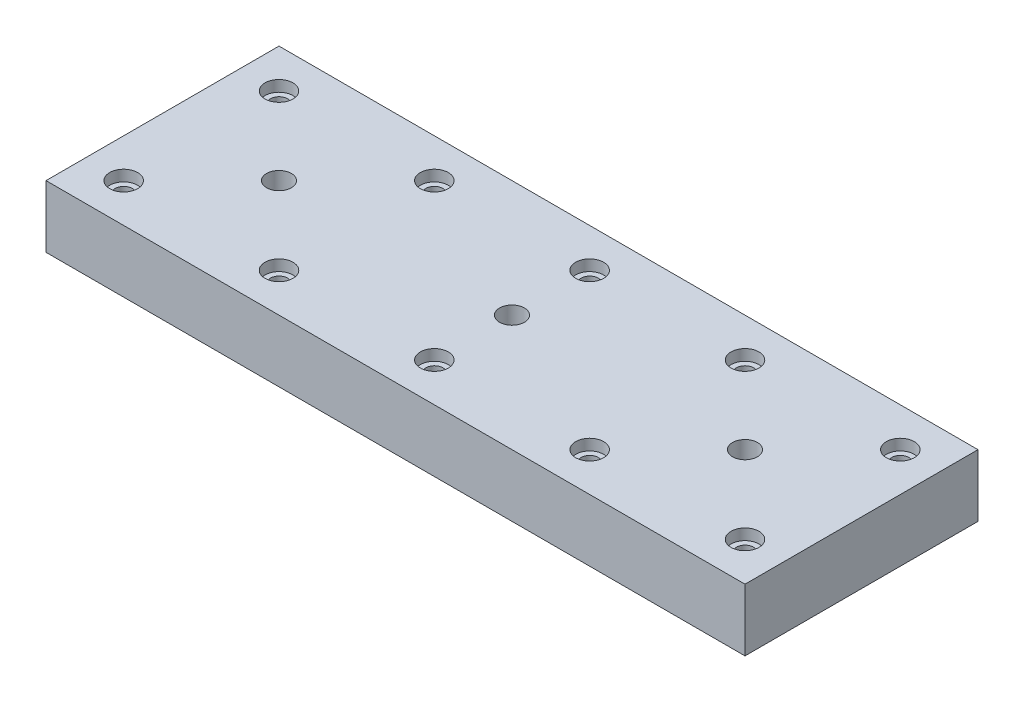
ISO-10303-21;
HEADER;
FILE_DESCRIPTION(('STEP AP214'),'2;1');
FILE_NAME('part.step','',(''),(''),'','','');
FILE_SCHEMA(('AUTOMOTIVE_DESIGN { 1 0 10303 214 1 1 1 1 }'));
ENDSEC;
DATA;
#1=APPLICATION_CONTEXT('core data for automotive mechanical design processes');
#2=APPLICATION_PROTOCOL_DEFINITION('international standard','automotive_design',2000,#1);
#3=PRODUCT_CONTEXT('',#1,'mechanical');
#4=PRODUCT('Part','Part','',(#3));
#5=PRODUCT_RELATED_PRODUCT_CATEGORY('part','',(#4));
#6=PRODUCT_DEFINITION_FORMATION('','',#4);
#7=PRODUCT_DEFINITION_CONTEXT('part definition',#1,'design');
#8=PRODUCT_DEFINITION('design','',#6,#7);
#9=PRODUCT_DEFINITION_SHAPE('','',#8);
#10=(LENGTH_UNIT() NAMED_UNIT(*) SI_UNIT(.MILLI.,.METRE.));
#11=(NAMED_UNIT(*) PLANE_ANGLE_UNIT() SI_UNIT($,.RADIAN.));
#12=(NAMED_UNIT(*) SI_UNIT($,.STERADIAN.) SOLID_ANGLE_UNIT());
#13=UNCERTAINTY_MEASURE_WITH_UNIT(LENGTH_MEASURE(1.E-05),#10,'distance_accuracy_value','');
#14=(GEOMETRIC_REPRESENTATION_CONTEXT(3) GLOBAL_UNCERTAINTY_ASSIGNED_CONTEXT((#13)) GLOBAL_UNIT_ASSIGNED_CONTEXT((#10,
#11,#12)) REPRESENTATION_CONTEXT('',''));
#15=CARTESIAN_POINT('',(0.,0.,0.));
#16=DIRECTION('',(0.,0.,1.));
#17=DIRECTION('',(1.,0.,0.));
#18=AXIS2_PLACEMENT_3D('',#15,#16,#17);
#19=CARTESIAN_POINT('',(0.,40.,0.));
#20=DIRECTION('',(0.,-1.,0.));
#21=DIRECTION('',(0.,0.,-1.));
#22=AXIS2_PLACEMENT_3D('',#19,#20,#21);
#23=PLANE('',#22);
#24=CARTESIAN_POINT('',(-200.,40.,-50.));
#25=DIRECTION('',(0.,1.,0.));
#26=DIRECTION('',(0.,0.,1.));
#27=AXIS2_PLACEMENT_3D('',#24,#25,#26);
#28=CIRCLE('',#27,9.00000000000001);
#29=CARTESIAN_POINT('',(-200.,40.,-41.));
#30=VERTEX_POINT('',#29);
#31=EDGE_CURVE('E229',#30,#30,#28,.T.);
#32=ORIENTED_EDGE('',*,*,#31,.F.);
#33=EDGE_LOOP('',(#32));
#34=FACE_BOUND('',#33,.T.);
#35=CARTESIAN_POINT('',(-100.,40.,-50.));
#36=DIRECTION('',(0.,1.,0.));
#37=DIRECTION('',(0.,0.,1.));
#38=AXIS2_PLACEMENT_3D('',#35,#36,#37);
#39=CIRCLE('',#38,8.99999999999999);
#40=CARTESIAN_POINT('',(-100.,40.,-41.));
#41=VERTEX_POINT('',#40);
#42=EDGE_CURVE('E217',#41,#41,#39,.T.);
#43=ORIENTED_EDGE('',*,*,#42,.F.);
#44=EDGE_LOOP('',(#43));
#45=FACE_BOUND('',#44,.T.);
#46=CARTESIAN_POINT('',(0.,40.,-50.));
#47=DIRECTION('',(0.,1.,0.));
#48=DIRECTION('',(0.,0.,1.));
#49=AXIS2_PLACEMENT_3D('',#46,#47,#48);
#50=CIRCLE('',#49,9.);
#51=CARTESIAN_POINT('',(0.,40.,-41.));
#52=VERTEX_POINT('',#51);
#53=EDGE_CURVE('E205',#52,#52,#50,.T.);
#54=ORIENTED_EDGE('',*,*,#53,.F.);
#55=EDGE_LOOP('',(#54));
#56=FACE_BOUND('',#55,.T.);
#57=CARTESIAN_POINT('',(100.,40.,-50.));
#58=DIRECTION('',(0.,1.,0.));
#59=DIRECTION('',(0.,0.,1.));
#60=AXIS2_PLACEMENT_3D('',#57,#58,#59);
#61=CIRCLE('',#60,8.99999999999999);
#62=CARTESIAN_POINT('',(100.,40.,-41.));
#63=VERTEX_POINT('',#62);
#64=EDGE_CURVE('E193',#63,#63,#61,.T.);
#65=ORIENTED_EDGE('',*,*,#64,.F.);
#66=EDGE_LOOP('',(#65));
#67=FACE_BOUND('',#66,.T.);
#68=CARTESIAN_POINT('',(200.,40.,-50.));
#69=DIRECTION('',(0.,1.,0.));
#70=DIRECTION('',(0.,0.,1.));
#71=AXIS2_PLACEMENT_3D('',#68,#69,#70);
#72=CIRCLE('',#71,9.00000000000001);
#73=CARTESIAN_POINT('',(200.,40.,-41.));
#74=VERTEX_POINT('',#73);
#75=EDGE_CURVE('E181',#74,#74,#72,.T.);
#76=ORIENTED_EDGE('',*,*,#75,.F.);
#77=EDGE_LOOP('',(#76));
#78=FACE_BOUND('',#77,.T.);
#79=CARTESIAN_POINT('',(-99.9999999999947,40.,50.));
#80=DIRECTION('',(0.,1.,0.));
#81=DIRECTION('',(0.,0.,1.));
#82=AXIS2_PLACEMENT_3D('',#79,#80,#81);
#83=CIRCLE('',#82,8.99999999999999);
#84=CARTESIAN_POINT('',(-99.9999999999947,40.,59.));
#85=VERTEX_POINT('',#84);
#86=EDGE_CURVE('E169',#85,#85,#83,.T.);
#87=ORIENTED_EDGE('',*,*,#86,.F.);
#88=EDGE_LOOP('',(#87));
#89=FACE_BOUND('',#88,.T.);
#90=CARTESIAN_POINT('',(5.27355936696949E-12,40.,50.));
#91=DIRECTION('',(0.,1.,0.));
#92=DIRECTION('',(0.,0.,1.));
#93=AXIS2_PLACEMENT_3D('',#90,#91,#92);
#94=CIRCLE('',#93,9.);
#95=CARTESIAN_POINT('',(5.27355936696949E-12,40.,59.));
#96=VERTEX_POINT('',#95);
#97=EDGE_CURVE('E157',#96,#96,#94,.T.);
#98=ORIENTED_EDGE('',*,*,#97,.F.);
#99=EDGE_LOOP('',(#98));
#100=FACE_BOUND('',#99,.T.);
#101=CARTESIAN_POINT('',(100.000000000005,40.,50.));
#102=DIRECTION('',(0.,1.,0.));
#103=DIRECTION('',(0.,0.,1.));
#104=AXIS2_PLACEMENT_3D('',#101,#102,#103);
#105=CIRCLE('',#104,8.99999999999999);
#106=CARTESIAN_POINT('',(100.000000000005,40.,59.));
#107=VERTEX_POINT('',#106);
#108=EDGE_CURVE('E145',#107,#107,#105,.T.);
#109=ORIENTED_EDGE('',*,*,#108,.F.);
#110=EDGE_LOOP('',(#109));
#111=FACE_BOUND('',#110,.T.);
#112=CARTESIAN_POINT('',(200.000000000005,40.,50.));
#113=DIRECTION('',(0.,1.,0.));
#114=DIRECTION('',(0.,0.,1.));
#115=AXIS2_PLACEMENT_3D('',#112,#113,#114);
#116=CIRCLE('',#115,9.00000000000001);
#117=CARTESIAN_POINT('',(200.000000000005,40.,59.));
#118=VERTEX_POINT('',#117);
#119=EDGE_CURVE('E133',#118,#118,#116,.T.);
#120=ORIENTED_EDGE('',*,*,#119,.F.);
#121=EDGE_LOOP('',(#120));
#122=FACE_BOUND('',#121,.T.);
#123=CARTESIAN_POINT('',(-199.999999999995,40.,50.));
#124=DIRECTION('',(0.,1.,0.));
#125=DIRECTION('',(0.,0.,1.));
#126=AXIS2_PLACEMENT_3D('',#123,#124,#125);
#127=CIRCLE('',#126,9.00000000000001);
#128=CARTESIAN_POINT('',(-199.999999999995,40.,59.));
#129=VERTEX_POINT('',#128);
#130=EDGE_CURVE('E121',#129,#129,#127,.T.);
#131=ORIENTED_EDGE('',*,*,#130,.F.);
#132=EDGE_LOOP('',(#131));
#133=FACE_BOUND('',#132,.T.);
#134=DIRECTION('',(0.,0.,-1.));
#135=VECTOR('',#134,1.);
#136=CARTESIAN_POINT('',(225.,40.,75.));
#137=LINE('',#136,#135);
#138=CARTESIAN_POINT('',(225.,40.,75.));
#139=VERTEX_POINT('',#138);
#140=CARTESIAN_POINT('',(225.,40.,-75.));
#141=VERTEX_POINT('',#140);
#142=EDGE_CURVE('E87',#139,#141,#137,.T.);
#143=ORIENTED_EDGE('',*,*,#142,.T.);
#144=DIRECTION('',(-1.,0.,0.));
#145=VECTOR('',#144,1.);
#146=CARTESIAN_POINT('',(-225.,40.,-75.));
#147=LINE('',#146,#145);
#148=CARTESIAN_POINT('',(-225.,40.,-75.));
#149=VERTEX_POINT('',#148);
#150=EDGE_CURVE('E82',#141,#149,#147,.T.);
#151=ORIENTED_EDGE('',*,*,#150,.T.);
#152=DIRECTION('',(0.,0.,1.));
#153=VECTOR('',#152,1.);
#154=CARTESIAN_POINT('',(-225.,40.,75.));
#155=LINE('',#154,#153);
#156=CARTESIAN_POINT('',(-225.,40.,75.));
#157=VERTEX_POINT('',#156);
#158=EDGE_CURVE('E85',#149,#157,#155,.T.);
#159=ORIENTED_EDGE('',*,*,#158,.T.);
#160=DIRECTION('',(1.,0.,0.));
#161=VECTOR('',#160,1.);
#162=CARTESIAN_POINT('',(-225.,40.,75.));
#163=LINE('',#162,#161);
#164=EDGE_CURVE('E52',#157,#139,#163,.T.);
#165=ORIENTED_EDGE('',*,*,#164,.T.);
#166=EDGE_LOOP('',(#143,#151,#159,#165));
#167=FACE_BOUND('',#166,.T.);
#168=CARTESIAN_POINT('',(-150.,40.,0.));
#169=DIRECTION('',(0.,1.,0.));
#170=DIRECTION('',(0.,0.,1.));
#171=AXIS2_PLACEMENT_3D('',#168,#169,#170);
#172=CIRCLE('',#171,8.00000000000001);
#173=CARTESIAN_POINT('',(-150.,40.,8.00000000000001));
#174=VERTEX_POINT('',#173);
#175=EDGE_CURVE('E235',#174,#174,#172,.T.);
#176=ORIENTED_EDGE('',*,*,#175,.F.);
#177=EDGE_LOOP('',(#176));
#178=FACE_BOUND('',#177,.T.);
#179=CARTESIAN_POINT('',(0.,40.,0.));
#180=DIRECTION('',(0.,1.,0.));
#181=DIRECTION('',(0.,0.,1.));
#182=AXIS2_PLACEMENT_3D('',#179,#180,#181);
#183=CIRCLE('',#182,7.99999999999999);
#184=CARTESIAN_POINT('',(0.,40.,7.99999999999999));
#185=VERTEX_POINT('',#184);
#186=EDGE_CURVE('E241',#185,#185,#183,.T.);
#187=ORIENTED_EDGE('',*,*,#186,.F.);
#188=EDGE_LOOP('',(#187));
#189=FACE_BOUND('',#188,.T.);
#190=CARTESIAN_POINT('',(150.,40.,0.));
#191=DIRECTION('',(0.,1.,0.));
#192=DIRECTION('',(0.,0.,1.));
#193=AXIS2_PLACEMENT_3D('',#190,#191,#192);
#194=CIRCLE('',#193,8.00000000000001);
#195=CARTESIAN_POINT('',(150.,40.,8.00000000000001));
#196=VERTEX_POINT('',#195);
#197=EDGE_CURVE('E247',#196,#196,#194,.T.);
#198=ORIENTED_EDGE('',*,*,#197,.F.);
#199=EDGE_LOOP('',(#198));
#200=FACE_BOUND('',#199,.T.);
#201=ADVANCED_FACE('F35',(#34,#45,#56,#67,#78,#89,#100,#111,#122,#133,#167,#178,#189,#200),#23,.F.);
#202=CARTESIAN_POINT('',(225.,40.,75.));
#203=DIRECTION('',(-1.,0.,0.));
#204=DIRECTION('',(0.,0.,1.));
#205=AXIS2_PLACEMENT_3D('',#202,#203,#204);
#206=PLANE('',#205);
#207=DIRECTION('',(0.,0.,-1.));
#208=VECTOR('',#207,1.);
#209=CARTESIAN_POINT('',(225.,0.,75.));
#210=LINE('',#209,#208);
#211=CARTESIAN_POINT('',(225.,0.,75.));
#212=VERTEX_POINT('',#211);
#213=CARTESIAN_POINT('',(225.,0.,-75.));
#214=VERTEX_POINT('',#213);
#215=EDGE_CURVE('E99',#212,#214,#210,.T.);
#216=ORIENTED_EDGE('',*,*,#215,.T.);
#217=DIRECTION('',(0.,-1.,0.));
#218=VECTOR('',#217,1.);
#219=CARTESIAN_POINT('',(225.,40.,-75.));
#220=LINE('',#219,#218);
#221=EDGE_CURVE('E11',#141,#214,#220,.T.);
#222=ORIENTED_EDGE('',*,*,#221,.F.);
#223=ORIENTED_EDGE('',*,*,#142,.F.);
#224=DIRECTION('',(0.,-1.,0.));
#225=VECTOR('',#224,1.);
#226=CARTESIAN_POINT('',(225.,40.,75.));
#227=LINE('',#226,#225);
#228=EDGE_CURVE('E95',#139,#212,#227,.T.);
#229=ORIENTED_EDGE('',*,*,#228,.T.);
#230=EDGE_LOOP('',(#216,#222,#223,#229));
#231=FACE_BOUND('',#230,.T.);
#232=ADVANCED_FACE('F37',(#231),#206,.F.);
#233=CARTESIAN_POINT('',(-225.,40.,-75.));
#234=DIRECTION('',(0.,0.,1.));
#235=DIRECTION('',(1.,0.,0.));
#236=AXIS2_PLACEMENT_3D('',#233,#234,#235);
#237=PLANE('',#236);
#238=DIRECTION('',(-1.,0.,0.));
#239=VECTOR('',#238,1.);
#240=CARTESIAN_POINT('',(-225.,0.,-75.));
#241=LINE('',#240,#239);
#242=CARTESIAN_POINT('',(-225.,0.,-75.));
#243=VERTEX_POINT('',#242);
#244=EDGE_CURVE('E91',#214,#243,#241,.T.);
#245=ORIENTED_EDGE('',*,*,#244,.T.);
#246=DIRECTION('',(0.,-1.,0.));
#247=VECTOR('',#246,1.);
#248=CARTESIAN_POINT('',(-225.,40.,-75.));
#249=LINE('',#248,#247);
#250=EDGE_CURVE('E44',#149,#243,#249,.T.);
#251=ORIENTED_EDGE('',*,*,#250,.F.);
#252=ORIENTED_EDGE('',*,*,#150,.F.);
#253=ORIENTED_EDGE('',*,*,#221,.T.);
#254=EDGE_LOOP('',(#245,#251,#252,#253));
#255=FACE_BOUND('',#254,.T.);
#256=ADVANCED_FACE('F90',(#255),#237,.F.);
#257=CARTESIAN_POINT('',(-225.,40.,75.));
#258=DIRECTION('',(1.,0.,0.));
#259=DIRECTION('',(0.,0.,-1.));
#260=AXIS2_PLACEMENT_3D('',#257,#258,#259);
#261=PLANE('',#260);
#262=DIRECTION('',(0.,0.,1.));
#263=VECTOR('',#262,1.);
#264=CARTESIAN_POINT('',(-225.,0.,75.));
#265=LINE('',#264,#263);
#266=CARTESIAN_POINT('',(-225.,0.,75.));
#267=VERTEX_POINT('',#266);
#268=EDGE_CURVE('E69',#243,#267,#265,.T.);
#269=ORIENTED_EDGE('',*,*,#268,.T.);
#270=DIRECTION('',(0.,-1.,0.));
#271=VECTOR('',#270,1.);
#272=CARTESIAN_POINT('',(-225.,40.,75.));
#273=LINE('',#272,#271);
#274=EDGE_CURVE('E92',#157,#267,#273,.T.);
#275=ORIENTED_EDGE('',*,*,#274,.F.);
#276=ORIENTED_EDGE('',*,*,#158,.F.);
#277=ORIENTED_EDGE('',*,*,#250,.T.);
#278=EDGE_LOOP('',(#269,#275,#276,#277));
#279=FACE_BOUND('',#278,.T.);
#280=ADVANCED_FACE('F93',(#279),#261,.F.);
#281=CARTESIAN_POINT('',(-225.,40.,75.));
#282=DIRECTION('',(0.,0.,-1.));
#283=DIRECTION('',(-1.,0.,0.));
#284=AXIS2_PLACEMENT_3D('',#281,#282,#283);
#285=PLANE('',#284);
#286=DIRECTION('',(1.,0.,0.));
#287=VECTOR('',#286,1.);
#288=CARTESIAN_POINT('',(-225.,0.,75.));
#289=LINE('',#288,#287);
#290=EDGE_CURVE('E75',#267,#212,#289,.T.);
#291=ORIENTED_EDGE('',*,*,#290,.T.);
#292=ORIENTED_EDGE('',*,*,#228,.F.);
#293=ORIENTED_EDGE('',*,*,#164,.F.);
#294=ORIENTED_EDGE('',*,*,#274,.T.);
#295=EDGE_LOOP('',(#291,#292,#293,#294));
#296=FACE_BOUND('',#295,.T.);
#297=ADVANCED_FACE('F107',(#296),#285,.F.);
#298=CARTESIAN_POINT('',(0.,0.,0.));
#299=DIRECTION('',(0.,-1.,0.));
#300=DIRECTION('',(0.,0.,-1.));
#301=AXIS2_PLACEMENT_3D('',#298,#299,#300);
#302=PLANE('',#301);
#303=CARTESIAN_POINT('',(150.,0.,0.));
#304=DIRECTION('',(0.,-1.,0.));
#305=DIRECTION('',(0.,0.,-1.));
#306=AXIS2_PLACEMENT_3D('',#303,#304,#305);
#307=CIRCLE('',#306,7.99999999999999);
#308=CARTESIAN_POINT('',(150.,0.,-7.99999999999999));
#309=VERTEX_POINT('',#308);
#310=EDGE_CURVE('E244',#309,#309,#307,.T.);
#311=ORIENTED_EDGE('',*,*,#310,.F.);
#312=EDGE_LOOP('',(#311));
#313=FACE_BOUND('',#312,.T.);
#314=CARTESIAN_POINT('',(0.,0.,0.));
#315=DIRECTION('',(0.,-1.,0.));
#316=DIRECTION('',(0.,0.,-1.));
#317=AXIS2_PLACEMENT_3D('',#314,#315,#316);
#318=CIRCLE('',#317,7.99999999999999);
#319=CARTESIAN_POINT('',(0.,0.,-7.99999999999999));
#320=VERTEX_POINT('',#319);
#321=EDGE_CURVE('E238',#320,#320,#318,.T.);
#322=ORIENTED_EDGE('',*,*,#321,.F.);
#323=EDGE_LOOP('',(#322));
#324=FACE_BOUND('',#323,.T.);
#325=CARTESIAN_POINT('',(-150.,0.,0.));
#326=DIRECTION('',(0.,-1.,0.));
#327=DIRECTION('',(0.,0.,-1.));
#328=AXIS2_PLACEMENT_3D('',#325,#326,#327);
#329=CIRCLE('',#328,7.99999999999999);
#330=CARTESIAN_POINT('',(-150.,0.,-7.99999999999999));
#331=VERTEX_POINT('',#330);
#332=EDGE_CURVE('E232',#331,#331,#329,.T.);
#333=ORIENTED_EDGE('',*,*,#332,.F.);
#334=EDGE_LOOP('',(#333));
#335=FACE_BOUND('',#334,.T.);
#336=CARTESIAN_POINT('',(-200.,0.,-50.));
#337=DIRECTION('',(0.,-1.,0.));
#338=DIRECTION('',(0.,0.,-1.));
#339=AXIS2_PLACEMENT_3D('',#336,#337,#338);
#340=CIRCLE('',#339,5.49999999999999);
#341=CARTESIAN_POINT('',(-200.,0.,-55.5));
#342=VERTEX_POINT('',#341);
#343=EDGE_CURVE('E220',#342,#342,#340,.T.);
#344=ORIENTED_EDGE('',*,*,#343,.F.);
#345=EDGE_LOOP('',(#344));
#346=FACE_BOUND('',#345,.T.);
#347=CARTESIAN_POINT('',(-100.,0.,-50.));
#348=DIRECTION('',(0.,-1.,0.));
#349=DIRECTION('',(0.,0.,-1.));
#350=AXIS2_PLACEMENT_3D('',#347,#348,#349);
#351=CIRCLE('',#350,5.5);
#352=CARTESIAN_POINT('',(-100.,0.,-55.5));
#353=VERTEX_POINT('',#352);
#354=EDGE_CURVE('E208',#353,#353,#351,.T.);
#355=ORIENTED_EDGE('',*,*,#354,.F.);
#356=EDGE_LOOP('',(#355));
#357=FACE_BOUND('',#356,.T.);
#358=CARTESIAN_POINT('',(0.,0.,-50.));
#359=DIRECTION('',(0.,-1.,0.));
#360=DIRECTION('',(0.,0.,-1.));
#361=AXIS2_PLACEMENT_3D('',#358,#359,#360);
#362=CIRCLE('',#361,5.49999999999999);
#363=CARTESIAN_POINT('',(0.,0.,-55.5));
#364=VERTEX_POINT('',#363);
#365=EDGE_CURVE('E196',#364,#364,#362,.T.);
#366=ORIENTED_EDGE('',*,*,#365,.F.);
#367=EDGE_LOOP('',(#366));
#368=FACE_BOUND('',#367,.T.);
#369=CARTESIAN_POINT('',(100.,0.,-50.));
#370=DIRECTION('',(0.,-1.,0.));
#371=DIRECTION('',(0.,0.,-1.));
#372=AXIS2_PLACEMENT_3D('',#369,#370,#371);
#373=CIRCLE('',#372,5.5);
#374=CARTESIAN_POINT('',(100.,0.,-55.5));
#375=VERTEX_POINT('',#374);
#376=EDGE_CURVE('E184',#375,#375,#373,.T.);
#377=ORIENTED_EDGE('',*,*,#376,.F.);
#378=EDGE_LOOP('',(#377));
#379=FACE_BOUND('',#378,.T.);
#380=CARTESIAN_POINT('',(200.,0.,-50.));
#381=DIRECTION('',(0.,-1.,0.));
#382=DIRECTION('',(0.,0.,-1.));
#383=AXIS2_PLACEMENT_3D('',#380,#381,#382);
#384=CIRCLE('',#383,5.49999999999999);
#385=CARTESIAN_POINT('',(200.,0.,-55.5));
#386=VERTEX_POINT('',#385);
#387=EDGE_CURVE('E172',#386,#386,#384,.T.);
#388=ORIENTED_EDGE('',*,*,#387,.F.);
#389=EDGE_LOOP('',(#388));
#390=FACE_BOUND('',#389,.T.);
#391=CARTESIAN_POINT('',(-99.9999999999947,0.,50.));
#392=DIRECTION('',(0.,-1.,0.));
#393=DIRECTION('',(0.,0.,-1.));
#394=AXIS2_PLACEMENT_3D('',#391,#392,#393);
#395=CIRCLE('',#394,5.49999999999999);
#396=CARTESIAN_POINT('',(-99.9999999999947,0.,44.5));
#397=VERTEX_POINT('',#396);
#398=EDGE_CURVE('E160',#397,#397,#395,.T.);
#399=ORIENTED_EDGE('',*,*,#398,.F.);
#400=EDGE_LOOP('',(#399));
#401=FACE_BOUND('',#400,.T.);
#402=CARTESIAN_POINT('',(5.27355936696949E-12,0.,50.));
#403=DIRECTION('',(0.,-1.,0.));
#404=DIRECTION('',(0.,0.,-1.));
#405=AXIS2_PLACEMENT_3D('',#402,#403,#404);
#406=CIRCLE('',#405,5.49999999999999);
#407=CARTESIAN_POINT('',(5.27355936696949E-12,0.,44.5));
#408=VERTEX_POINT('',#407);
#409=EDGE_CURVE('E148',#408,#408,#406,.T.);
#410=ORIENTED_EDGE('',*,*,#409,.F.);
#411=EDGE_LOOP('',(#410));
#412=FACE_BOUND('',#411,.T.);
#413=CARTESIAN_POINT('',(100.000000000005,0.,50.));
#414=DIRECTION('',(0.,-1.,0.));
#415=DIRECTION('',(0.,0.,-1.));
#416=AXIS2_PLACEMENT_3D('',#413,#414,#415);
#417=CIRCLE('',#416,5.5);
#418=CARTESIAN_POINT('',(100.000000000005,0.,44.5));
#419=VERTEX_POINT('',#418);
#420=EDGE_CURVE('E136',#419,#419,#417,.T.);
#421=ORIENTED_EDGE('',*,*,#420,.F.);
#422=EDGE_LOOP('',(#421));
#423=FACE_BOUND('',#422,.T.);
#424=CARTESIAN_POINT('',(200.000000000005,0.,50.));
#425=DIRECTION('',(0.,-1.,0.));
#426=DIRECTION('',(0.,0.,-1.));
#427=AXIS2_PLACEMENT_3D('',#424,#425,#426);
#428=CIRCLE('',#427,5.49999999999999);
#429=CARTESIAN_POINT('',(200.000000000005,0.,44.5));
#430=VERTEX_POINT('',#429);
#431=EDGE_CURVE('E124',#430,#430,#428,.T.);
#432=ORIENTED_EDGE('',*,*,#431,.F.);
#433=EDGE_LOOP('',(#432));
#434=FACE_BOUND('',#433,.T.);
#435=CARTESIAN_POINT('',(-199.999999999995,0.,50.));
#436=DIRECTION('',(0.,-1.,0.));
#437=DIRECTION('',(0.,0.,-1.));
#438=AXIS2_PLACEMENT_3D('',#435,#436,#437);
#439=CIRCLE('',#438,5.49999999999999);
#440=CARTESIAN_POINT('',(-199.999999999995,0.,44.5));
#441=VERTEX_POINT('',#440);
#442=EDGE_CURVE('E102',#441,#441,#439,.T.);
#443=ORIENTED_EDGE('',*,*,#442,.F.);
#444=EDGE_LOOP('',(#443));
#445=FACE_BOUND('',#444,.T.);
#446=ORIENTED_EDGE('',*,*,#215,.F.);
#447=ORIENTED_EDGE('',*,*,#290,.F.);
#448=ORIENTED_EDGE('',*,*,#268,.F.);
#449=ORIENTED_EDGE('',*,*,#244,.F.);
#450=EDGE_LOOP('',(#446,#447,#448,#449));
#451=FACE_BOUND('',#450,.T.);
#452=ADVANCED_FACE('F110',(#313,#324,#335,#346,#357,#368,#379,#390,#401,#412,#423,#434,#445,
#451),#302,.T.);
#453=CARTESIAN_POINT('',(-199.999999999995,40.,50.));
#454=DIRECTION('',(0.,1.,0.));
#455=DIRECTION('',(0.,0.,1.));
#456=AXIS2_PLACEMENT_3D('',#453,#454,#455);
#457=CYLINDRICAL_SURFACE('',#456,5.49999999999999);
#458=CARTESIAN_POINT('',(-199.999999999995,32.9,50.));
#459=DIRECTION('',(0.,1.,0.));
#460=DIRECTION('',(0.,0.,1.));
#461=AXIS2_PLACEMENT_3D('',#458,#459,#460);
#462=CIRCLE('',#461,5.50000000000001);
#463=CARTESIAN_POINT('',(-199.999999999995,32.9,55.5));
#464=VERTEX_POINT('',#463);
#465=EDGE_CURVE('E115',#464,#464,#462,.T.);
#466=ORIENTED_EDGE('',*,*,#465,.T.);
#467=EDGE_LOOP('',(#466));
#468=FACE_BOUND('',#467,.T.);
#469=ORIENTED_EDGE('',*,*,#442,.T.);
#470=EDGE_LOOP('',(#469));
#471=FACE_BOUND('',#470,.T.);
#472=ADVANCED_FACE('F264',(#468,#471),#457,.F.);
#473=CARTESIAN_POINT('',(-194.499999999995,32.9,50.));
#474=DIRECTION('',(0.,-1.,0.));
#475=DIRECTION('',(0.,0.,-1.));
#476=AXIS2_PLACEMENT_3D('',#473,#474,#475);
#477=PLANE('',#476);
#478=ORIENTED_EDGE('',*,*,#465,.F.);
#479=EDGE_LOOP('',(#478));
#480=FACE_BOUND('',#479,.T.);
#481=CARTESIAN_POINT('',(-199.999999999995,32.9,50.));
#482=DIRECTION('',(0.,1.,0.));
#483=DIRECTION('',(0.,0.,1.));
#484=AXIS2_PLACEMENT_3D('',#481,#482,#483);
#485=CIRCLE('',#484,9.00000000000001);
#486=CARTESIAN_POINT('',(-199.999999999995,32.9,59.));
#487=VERTEX_POINT('',#486);
#488=EDGE_CURVE('E118',#487,#487,#485,.T.);
#489=ORIENTED_EDGE('',*,*,#488,.T.);
#490=EDGE_LOOP('',(#489));
#491=FACE_BOUND('',#490,.T.);
#492=ADVANCED_FACE('F296',(#480,#491),#477,.F.);
#493=CARTESIAN_POINT('',(-199.999999999995,40.,50.));
#494=DIRECTION('',(0.,1.,0.));
#495=DIRECTION('',(0.,0.,1.));
#496=AXIS2_PLACEMENT_3D('',#493,#494,#495);
#497=CYLINDRICAL_SURFACE('',#496,9.00000000000001);
#498=ORIENTED_EDGE('',*,*,#488,.F.);
#499=EDGE_LOOP('',(#498));
#500=FACE_BOUND('',#499,.T.);
#501=ORIENTED_EDGE('',*,*,#130,.T.);
#502=EDGE_LOOP('',(#501));
#503=FACE_BOUND('',#502,.T.);
#504=ADVANCED_FACE('F303',(#500,#503),#497,.F.);
#505=CARTESIAN_POINT('',(200.000000000005,40.,50.));
#506=DIRECTION('',(0.,1.,0.));
#507=DIRECTION('',(0.,0.,1.));
#508=AXIS2_PLACEMENT_3D('',#505,#506,#507);
#509=CYLINDRICAL_SURFACE('',#508,5.49999999999999);
#510=CARTESIAN_POINT('',(200.000000000005,32.9,50.));
#511=DIRECTION('',(0.,1.,0.));
#512=DIRECTION('',(0.,0.,1.));
#513=AXIS2_PLACEMENT_3D('',#510,#511,#512);
#514=CIRCLE('',#513,5.50000000000001);
#515=CARTESIAN_POINT('',(200.000000000005,32.9,55.5));
#516=VERTEX_POINT('',#515);
#517=EDGE_CURVE('E127',#516,#516,#514,.T.);
#518=ORIENTED_EDGE('',*,*,#517,.T.);
#519=EDGE_LOOP('',(#518));
#520=FACE_BOUND('',#519,.T.);
#521=ORIENTED_EDGE('',*,*,#431,.T.);
#522=EDGE_LOOP('',(#521));
#523=FACE_BOUND('',#522,.T.);
#524=ADVANCED_FACE('F310',(#520,#523),#509,.F.);
#525=CARTESIAN_POINT('',(205.500000000005,32.9,50.));
#526=DIRECTION('',(0.,-1.,0.));
#527=DIRECTION('',(0.,0.,-1.));
#528=AXIS2_PLACEMENT_3D('',#525,#526,#527);
#529=PLANE('',#528);
#530=ORIENTED_EDGE('',*,*,#517,.F.);
#531=EDGE_LOOP('',(#530));
#532=FACE_BOUND('',#531,.T.);
#533=CARTESIAN_POINT('',(200.000000000005,32.9,50.));
#534=DIRECTION('',(0.,1.,0.));
#535=DIRECTION('',(0.,0.,1.));
#536=AXIS2_PLACEMENT_3D('',#533,#534,#535);
#537=CIRCLE('',#536,9.00000000000001);
#538=CARTESIAN_POINT('',(200.000000000005,32.9,59.));
#539=VERTEX_POINT('',#538);
#540=EDGE_CURVE('E130',#539,#539,#537,.T.);
#541=ORIENTED_EDGE('',*,*,#540,.T.);
#542=EDGE_LOOP('',(#541));
#543=FACE_BOUND('',#542,.T.);
#544=ADVANCED_FACE('F318',(#532,#543),#529,.F.);
#545=CARTESIAN_POINT('',(200.000000000005,40.,50.));
#546=DIRECTION('',(0.,1.,0.));
#547=DIRECTION('',(0.,0.,1.));
#548=AXIS2_PLACEMENT_3D('',#545,#546,#547);
#549=CYLINDRICAL_SURFACE('',#548,9.00000000000001);
#550=ORIENTED_EDGE('',*,*,#540,.F.);
#551=EDGE_LOOP('',(#550));
#552=FACE_BOUND('',#551,.T.);
#553=ORIENTED_EDGE('',*,*,#119,.T.);
#554=EDGE_LOOP('',(#553));
#555=FACE_BOUND('',#554,.T.);
#556=ADVANCED_FACE('F326',(#552,#555),#549,.F.);
#557=CARTESIAN_POINT('',(100.000000000005,40.,50.));
#558=DIRECTION('',(0.,1.,0.));
#559=DIRECTION('',(0.,0.,1.));
#560=AXIS2_PLACEMENT_3D('',#557,#558,#559);
#561=CYLINDRICAL_SURFACE('',#560,5.5);
#562=CARTESIAN_POINT('',(100.000000000005,32.9,50.));
#563=DIRECTION('',(0.,1.,0.));
#564=DIRECTION('',(0.,0.,1.));
#565=AXIS2_PLACEMENT_3D('',#562,#563,#564);
#566=CIRCLE('',#565,5.50000000000001);
#567=CARTESIAN_POINT('',(100.000000000005,32.9,55.5));
#568=VERTEX_POINT('',#567);
#569=EDGE_CURVE('E139',#568,#568,#566,.T.);
#570=ORIENTED_EDGE('',*,*,#569,.T.);
#571=EDGE_LOOP('',(#570));
#572=FACE_BOUND('',#571,.T.);
#573=ORIENTED_EDGE('',*,*,#420,.T.);
#574=EDGE_LOOP('',(#573));
#575=FACE_BOUND('',#574,.T.);
#576=ADVANCED_FACE('F334',(#572,#575),#561,.F.);
#577=CARTESIAN_POINT('',(105.500000000005,32.9,50.));
#578=DIRECTION('',(0.,-1.,0.));
#579=DIRECTION('',(0.,0.,-1.));
#580=AXIS2_PLACEMENT_3D('',#577,#578,#579);
#581=PLANE('',#580);
#582=ORIENTED_EDGE('',*,*,#569,.F.);
#583=EDGE_LOOP('',(#582));
#584=FACE_BOUND('',#583,.T.);
#585=CARTESIAN_POINT('',(100.000000000005,32.9,50.));
#586=DIRECTION('',(0.,1.,0.));
#587=DIRECTION('',(0.,0.,1.));
#588=AXIS2_PLACEMENT_3D('',#585,#586,#587);
#589=CIRCLE('',#588,9.00000000000001);
#590=CARTESIAN_POINT('',(100.000000000005,32.9,59.));
#591=VERTEX_POINT('',#590);
#592=EDGE_CURVE('E142',#591,#591,#589,.T.);
#593=ORIENTED_EDGE('',*,*,#592,.T.);
#594=EDGE_LOOP('',(#593));
#595=FACE_BOUND('',#594,.T.);
#596=ADVANCED_FACE('F342',(#584,#595),#581,.F.);
#597=CARTESIAN_POINT('',(100.000000000005,40.,50.));
#598=DIRECTION('',(0.,1.,0.));
#599=DIRECTION('',(0.,0.,1.));
#600=AXIS2_PLACEMENT_3D('',#597,#598,#599);
#601=CYLINDRICAL_SURFACE('',#600,9.);
#602=ORIENTED_EDGE('',*,*,#592,.F.);
#603=EDGE_LOOP('',(#602));
#604=FACE_BOUND('',#603,.T.);
#605=ORIENTED_EDGE('',*,*,#108,.T.);
#606=EDGE_LOOP('',(#605));
#607=FACE_BOUND('',#606,.T.);
#608=ADVANCED_FACE('F350',(#604,#607),#601,.F.);
#609=CARTESIAN_POINT('',(5.27355936696949E-12,40.,50.));
#610=DIRECTION('',(0.,1.,0.));
#611=DIRECTION('',(0.,0.,1.));
#612=AXIS2_PLACEMENT_3D('',#609,#610,#611);
#613=CYLINDRICAL_SURFACE('',#612,5.49999999999999);
#614=CARTESIAN_POINT('',(5.27355936696949E-12,32.9,50.));
#615=DIRECTION('',(0.,1.,0.));
#616=DIRECTION('',(0.,0.,1.));
#617=AXIS2_PLACEMENT_3D('',#614,#615,#616);
#618=CIRCLE('',#617,5.5);
#619=CARTESIAN_POINT('',(5.27355936696949E-12,32.9,55.5));
#620=VERTEX_POINT('',#619);
#621=EDGE_CURVE('E151',#620,#620,#618,.T.);
#622=ORIENTED_EDGE('',*,*,#621,.T.);
#623=EDGE_LOOP('',(#622));
#624=FACE_BOUND('',#623,.T.);
#625=ORIENTED_EDGE('',*,*,#409,.T.);
#626=EDGE_LOOP('',(#625));
#627=FACE_BOUND('',#626,.T.);
#628=ADVANCED_FACE('F358',(#624,#627),#613,.F.);
#629=CARTESIAN_POINT('',(5.50000000000527,32.9,50.));
#630=DIRECTION('',(0.,-1.,0.));
#631=DIRECTION('',(0.,0.,-1.));
#632=AXIS2_PLACEMENT_3D('',#629,#630,#631);
#633=PLANE('',#632);
#634=ORIENTED_EDGE('',*,*,#621,.F.);
#635=EDGE_LOOP('',(#634));
#636=FACE_BOUND('',#635,.T.);
#637=CARTESIAN_POINT('',(5.27355936696949E-12,32.9,50.));
#638=DIRECTION('',(0.,1.,0.));
#639=DIRECTION('',(0.,0.,1.));
#640=AXIS2_PLACEMENT_3D('',#637,#638,#639);
#641=CIRCLE('',#640,9.);
#642=CARTESIAN_POINT('',(5.27355936696949E-12,32.9,59.));
#643=VERTEX_POINT('',#642);
#644=EDGE_CURVE('E154',#643,#643,#641,.T.);
#645=ORIENTED_EDGE('',*,*,#644,.T.);
#646=EDGE_LOOP('',(#645));
#647=FACE_BOUND('',#646,.T.);
#648=ADVANCED_FACE('F366',(#636,#647),#633,.F.);
#649=CARTESIAN_POINT('',(5.27355936696949E-12,40.,50.));
#650=DIRECTION('',(0.,1.,0.));
#651=DIRECTION('',(0.,0.,1.));
#652=AXIS2_PLACEMENT_3D('',#649,#650,#651);
#653=CYLINDRICAL_SURFACE('',#652,9.);
#654=ORIENTED_EDGE('',*,*,#644,.F.);
#655=EDGE_LOOP('',(#654));
#656=FACE_BOUND('',#655,.T.);
#657=ORIENTED_EDGE('',*,*,#97,.T.);
#658=EDGE_LOOP('',(#657));
#659=FACE_BOUND('',#658,.T.);
#660=ADVANCED_FACE('F374',(#656,#659),#653,.F.);
#661=CARTESIAN_POINT('',(-99.9999999999947,40.,50.));
#662=DIRECTION('',(0.,1.,0.));
#663=DIRECTION('',(0.,0.,1.));
#664=AXIS2_PLACEMENT_3D('',#661,#662,#663);
#665=CYLINDRICAL_SURFACE('',#664,5.49999999999999);
#666=CARTESIAN_POINT('',(-99.9999999999947,32.9,50.));
#667=DIRECTION('',(0.,1.,0.));
#668=DIRECTION('',(0.,0.,1.));
#669=AXIS2_PLACEMENT_3D('',#666,#667,#668);
#670=CIRCLE('',#669,5.49999999999999);
#671=CARTESIAN_POINT('',(-99.9999999999947,32.9,55.5));
#672=VERTEX_POINT('',#671);
#673=EDGE_CURVE('E163',#672,#672,#670,.T.);
#674=ORIENTED_EDGE('',*,*,#673,.T.);
#675=EDGE_LOOP('',(#674));
#676=FACE_BOUND('',#675,.T.);
#677=ORIENTED_EDGE('',*,*,#398,.T.);
#678=EDGE_LOOP('',(#677));
#679=FACE_BOUND('',#678,.T.);
#680=ADVANCED_FACE('F382',(#676,#679),#665,.F.);
#681=CARTESIAN_POINT('',(-94.4999999999947,32.9,50.));
#682=DIRECTION('',(0.,-1.,0.));
#683=DIRECTION('',(0.,0.,-1.));
#684=AXIS2_PLACEMENT_3D('',#681,#682,#683);
#685=PLANE('',#684);
#686=ORIENTED_EDGE('',*,*,#673,.F.);
#687=EDGE_LOOP('',(#686));
#688=FACE_BOUND('',#687,.T.);
#689=CARTESIAN_POINT('',(-99.9999999999947,32.9,50.));
#690=DIRECTION('',(0.,1.,0.));
#691=DIRECTION('',(0.,0.,1.));
#692=AXIS2_PLACEMENT_3D('',#689,#690,#691);
#693=CIRCLE('',#692,8.99999999999999);
#694=CARTESIAN_POINT('',(-99.9999999999947,32.9,59.));
#695=VERTEX_POINT('',#694);
#696=EDGE_CURVE('E166',#695,#695,#693,.T.);
#697=ORIENTED_EDGE('',*,*,#696,.T.);
#698=EDGE_LOOP('',(#697));
#699=FACE_BOUND('',#698,.T.);
#700=ADVANCED_FACE('F390',(#688,#699),#685,.F.);
#701=CARTESIAN_POINT('',(-99.9999999999947,40.,50.));
#702=DIRECTION('',(0.,1.,0.));
#703=DIRECTION('',(0.,0.,1.));
#704=AXIS2_PLACEMENT_3D('',#701,#702,#703);
#705=CYLINDRICAL_SURFACE('',#704,8.99999999999999);
#706=ORIENTED_EDGE('',*,*,#696,.F.);
#707=EDGE_LOOP('',(#706));
#708=FACE_BOUND('',#707,.T.);
#709=ORIENTED_EDGE('',*,*,#86,.T.);
#710=EDGE_LOOP('',(#709));
#711=FACE_BOUND('',#710,.T.);
#712=ADVANCED_FACE('F398',(#708,#711),#705,.F.);
#713=CARTESIAN_POINT('',(200.,40.,-50.));
#714=DIRECTION('',(0.,1.,0.));
#715=DIRECTION('',(0.,0.,1.));
#716=AXIS2_PLACEMENT_3D('',#713,#714,#715);
#717=CYLINDRICAL_SURFACE('',#716,5.49999999999999);
#718=CARTESIAN_POINT('',(200.,32.9,-50.));
#719=DIRECTION('',(0.,1.,0.));
#720=DIRECTION('',(0.,0.,1.));
#721=AXIS2_PLACEMENT_3D('',#718,#719,#720);
#722=CIRCLE('',#721,5.50000000000001);
#723=CARTESIAN_POINT('',(200.,32.9,-44.5));
#724=VERTEX_POINT('',#723);
#725=EDGE_CURVE('E175',#724,#724,#722,.T.);
#726=ORIENTED_EDGE('',*,*,#725,.T.);
#727=EDGE_LOOP('',(#726));
#728=FACE_BOUND('',#727,.T.);
#729=ORIENTED_EDGE('',*,*,#387,.T.);
#730=EDGE_LOOP('',(#729));
#731=FACE_BOUND('',#730,.T.);
#732=ADVANCED_FACE('F406',(#728,#731),#717,.F.);
#733=CARTESIAN_POINT('',(205.5,32.9,-50.));
#734=DIRECTION('',(0.,-1.,0.));
#735=DIRECTION('',(0.,0.,-1.));
#736=AXIS2_PLACEMENT_3D('',#733,#734,#735);
#737=PLANE('',#736);
#738=ORIENTED_EDGE('',*,*,#725,.F.);
#739=EDGE_LOOP('',(#738));
#740=FACE_BOUND('',#739,.T.);
#741=CARTESIAN_POINT('',(200.,32.9,-50.));
#742=DIRECTION('',(0.,1.,0.));
#743=DIRECTION('',(0.,0.,1.));
#744=AXIS2_PLACEMENT_3D('',#741,#742,#743);
#745=CIRCLE('',#744,9.00000000000001);
#746=CARTESIAN_POINT('',(200.,32.9,-41.));
#747=VERTEX_POINT('',#746);
#748=EDGE_CURVE('E178',#747,#747,#745,.T.);
#749=ORIENTED_EDGE('',*,*,#748,.T.);
#750=EDGE_LOOP('',(#749));
#751=FACE_BOUND('',#750,.T.);
#752=ADVANCED_FACE('F414',(#740,#751),#737,.F.);
#753=CARTESIAN_POINT('',(200.,40.,-50.));
#754=DIRECTION('',(0.,1.,0.));
#755=DIRECTION('',(0.,0.,1.));
#756=AXIS2_PLACEMENT_3D('',#753,#754,#755);
#757=CYLINDRICAL_SURFACE('',#756,9.00000000000001);
#758=ORIENTED_EDGE('',*,*,#748,.F.);
#759=EDGE_LOOP('',(#758));
#760=FACE_BOUND('',#759,.T.);
#761=ORIENTED_EDGE('',*,*,#75,.T.);
#762=EDGE_LOOP('',(#761));
#763=FACE_BOUND('',#762,.T.);
#764=ADVANCED_FACE('F422',(#760,#763),#757,.F.);
#765=CARTESIAN_POINT('',(100.,40.,-50.));
#766=DIRECTION('',(0.,1.,0.));
#767=DIRECTION('',(0.,0.,1.));
#768=AXIS2_PLACEMENT_3D('',#765,#766,#767);
#769=CYLINDRICAL_SURFACE('',#768,5.5);
#770=CARTESIAN_POINT('',(100.,32.9,-50.));
#771=DIRECTION('',(0.,1.,0.));
#772=DIRECTION('',(0.,0.,1.));
#773=AXIS2_PLACEMENT_3D('',#770,#771,#772);
#774=CIRCLE('',#773,5.50000000000001);
#775=CARTESIAN_POINT('',(100.,32.9,-44.5));
#776=VERTEX_POINT('',#775);
#777=EDGE_CURVE('E187',#776,#776,#774,.T.);
#778=ORIENTED_EDGE('',*,*,#777,.T.);
#779=EDGE_LOOP('',(#778));
#780=FACE_BOUND('',#779,.T.);
#781=ORIENTED_EDGE('',*,*,#376,.T.);
#782=EDGE_LOOP('',(#781));
#783=FACE_BOUND('',#782,.T.);
#784=ADVANCED_FACE('F430',(#780,#783),#769,.F.);
#785=CARTESIAN_POINT('',(105.5,32.9,-50.));
#786=DIRECTION('',(0.,-1.,0.));
#787=DIRECTION('',(0.,0.,-1.));
#788=AXIS2_PLACEMENT_3D('',#785,#786,#787);
#789=PLANE('',#788);
#790=ORIENTED_EDGE('',*,*,#777,.F.);
#791=EDGE_LOOP('',(#790));
#792=FACE_BOUND('',#791,.T.);
#793=CARTESIAN_POINT('',(100.,32.9,-50.));
#794=DIRECTION('',(0.,1.,0.));
#795=DIRECTION('',(0.,0.,1.));
#796=AXIS2_PLACEMENT_3D('',#793,#794,#795);
#797=CIRCLE('',#796,9.00000000000001);
#798=CARTESIAN_POINT('',(100.,32.9,-41.));
#799=VERTEX_POINT('',#798);
#800=EDGE_CURVE('E190',#799,#799,#797,.T.);
#801=ORIENTED_EDGE('',*,*,#800,.T.);
#802=EDGE_LOOP('',(#801));
#803=FACE_BOUND('',#802,.T.);
#804=ADVANCED_FACE('F438',(#792,#803),#789,.F.);
#805=CARTESIAN_POINT('',(100.,40.,-50.));
#806=DIRECTION('',(0.,1.,0.));
#807=DIRECTION('',(0.,0.,1.));
#808=AXIS2_PLACEMENT_3D('',#805,#806,#807);
#809=CYLINDRICAL_SURFACE('',#808,9.);
#810=ORIENTED_EDGE('',*,*,#800,.F.);
#811=EDGE_LOOP('',(#810));
#812=FACE_BOUND('',#811,.T.);
#813=ORIENTED_EDGE('',*,*,#64,.T.);
#814=EDGE_LOOP('',(#813));
#815=FACE_BOUND('',#814,.T.);
#816=ADVANCED_FACE('F446',(#812,#815),#809,.F.);
#817=CARTESIAN_POINT('',(0.,40.,-50.));
#818=DIRECTION('',(0.,1.,0.));
#819=DIRECTION('',(0.,0.,1.));
#820=AXIS2_PLACEMENT_3D('',#817,#818,#819);
#821=CYLINDRICAL_SURFACE('',#820,5.49999999999999);
#822=CARTESIAN_POINT('',(0.,32.9,-50.));
#823=DIRECTION('',(0.,1.,0.));
#824=DIRECTION('',(0.,0.,1.));
#825=AXIS2_PLACEMENT_3D('',#822,#823,#824);
#826=CIRCLE('',#825,5.5);
#827=CARTESIAN_POINT('',(0.,32.9,-44.5));
#828=VERTEX_POINT('',#827);
#829=EDGE_CURVE('E199',#828,#828,#826,.T.);
#830=ORIENTED_EDGE('',*,*,#829,.T.);
#831=EDGE_LOOP('',(#830));
#832=FACE_BOUND('',#831,.T.);
#833=ORIENTED_EDGE('',*,*,#365,.T.);
#834=EDGE_LOOP('',(#833));
#835=FACE_BOUND('',#834,.T.);
#836=ADVANCED_FACE('F454',(#832,#835),#821,.F.);
#837=CARTESIAN_POINT('',(5.49999999999997,32.9,-50.));
#838=DIRECTION('',(0.,-1.,0.));
#839=DIRECTION('',(0.,0.,-1.));
#840=AXIS2_PLACEMENT_3D('',#837,#838,#839);
#841=PLANE('',#840);
#842=ORIENTED_EDGE('',*,*,#829,.F.);
#843=EDGE_LOOP('',(#842));
#844=FACE_BOUND('',#843,.T.);
#845=CARTESIAN_POINT('',(0.,32.9,-50.));
#846=DIRECTION('',(0.,1.,0.));
#847=DIRECTION('',(0.,0.,1.));
#848=AXIS2_PLACEMENT_3D('',#845,#846,#847);
#849=CIRCLE('',#848,9.);
#850=CARTESIAN_POINT('',(0.,32.9,-41.));
#851=VERTEX_POINT('',#850);
#852=EDGE_CURVE('E202',#851,#851,#849,.T.);
#853=ORIENTED_EDGE('',*,*,#852,.T.);
#854=EDGE_LOOP('',(#853));
#855=FACE_BOUND('',#854,.T.);
#856=ADVANCED_FACE('F462',(#844,#855),#841,.F.);
#857=CARTESIAN_POINT('',(0.,40.,-50.));
#858=DIRECTION('',(0.,1.,0.));
#859=DIRECTION('',(0.,0.,1.));
#860=AXIS2_PLACEMENT_3D('',#857,#858,#859);
#861=CYLINDRICAL_SURFACE('',#860,9.);
#862=ORIENTED_EDGE('',*,*,#852,.F.);
#863=EDGE_LOOP('',(#862));
#864=FACE_BOUND('',#863,.T.);
#865=ORIENTED_EDGE('',*,*,#53,.T.);
#866=EDGE_LOOP('',(#865));
#867=FACE_BOUND('',#866,.T.);
#868=ADVANCED_FACE('F470',(#864,#867),#861,.F.);
#869=CARTESIAN_POINT('',(-100.,40.,-50.));
#870=DIRECTION('',(0.,1.,0.));
#871=DIRECTION('',(0.,0.,1.));
#872=AXIS2_PLACEMENT_3D('',#869,#870,#871);
#873=CYLINDRICAL_SURFACE('',#872,5.5);
#874=CARTESIAN_POINT('',(-100.,32.9,-50.));
#875=DIRECTION('',(0.,1.,0.));
#876=DIRECTION('',(0.,0.,1.));
#877=AXIS2_PLACEMENT_3D('',#874,#875,#876);
#878=CIRCLE('',#877,5.50000000000001);
#879=CARTESIAN_POINT('',(-100.,32.9,-44.5));
#880=VERTEX_POINT('',#879);
#881=EDGE_CURVE('E211',#880,#880,#878,.T.);
#882=ORIENTED_EDGE('',*,*,#881,.T.);
#883=EDGE_LOOP('',(#882));
#884=FACE_BOUND('',#883,.T.);
#885=ORIENTED_EDGE('',*,*,#354,.T.);
#886=EDGE_LOOP('',(#885));
#887=FACE_BOUND('',#886,.T.);
#888=ADVANCED_FACE('F478',(#884,#887),#873,.F.);
#889=CARTESIAN_POINT('',(-94.5,32.9,-50.));
#890=DIRECTION('',(0.,-1.,0.));
#891=DIRECTION('',(0.,0.,-1.));
#892=AXIS2_PLACEMENT_3D('',#889,#890,#891);
#893=PLANE('',#892);
#894=ORIENTED_EDGE('',*,*,#881,.F.);
#895=EDGE_LOOP('',(#894));
#896=FACE_BOUND('',#895,.T.);
#897=CARTESIAN_POINT('',(-100.,32.9,-50.));
#898=DIRECTION('',(0.,1.,0.));
#899=DIRECTION('',(0.,0.,1.));
#900=AXIS2_PLACEMENT_3D('',#897,#898,#899);
#901=CIRCLE('',#900,9.00000000000001);
#902=CARTESIAN_POINT('',(-100.,32.9,-41.));
#903=VERTEX_POINT('',#902);
#904=EDGE_CURVE('E214',#903,#903,#901,.T.);
#905=ORIENTED_EDGE('',*,*,#904,.T.);
#906=EDGE_LOOP('',(#905));
#907=FACE_BOUND('',#906,.T.);
#908=ADVANCED_FACE('F486',(#896,#907),#893,.F.);
#909=CARTESIAN_POINT('',(-100.,40.,-50.));
#910=DIRECTION('',(0.,1.,0.));
#911=DIRECTION('',(0.,0.,1.));
#912=AXIS2_PLACEMENT_3D('',#909,#910,#911);
#913=CYLINDRICAL_SURFACE('',#912,9.);
#914=ORIENTED_EDGE('',*,*,#904,.F.);
#915=EDGE_LOOP('',(#914));
#916=FACE_BOUND('',#915,.T.);
#917=ORIENTED_EDGE('',*,*,#42,.T.);
#918=EDGE_LOOP('',(#917));
#919=FACE_BOUND('',#918,.T.);
#920=ADVANCED_FACE('F494',(#916,#919),#913,.F.);
#921=CARTESIAN_POINT('',(-200.,40.,-50.));
#922=DIRECTION('',(0.,1.,0.));
#923=DIRECTION('',(0.,0.,1.));
#924=AXIS2_PLACEMENT_3D('',#921,#922,#923);
#925=CYLINDRICAL_SURFACE('',#924,5.49999999999999);
#926=CARTESIAN_POINT('',(-200.,32.9,-50.));
#927=DIRECTION('',(0.,1.,0.));
#928=DIRECTION('',(0.,0.,1.));
#929=AXIS2_PLACEMENT_3D('',#926,#927,#928);
#930=CIRCLE('',#929,5.50000000000001);
#931=CARTESIAN_POINT('',(-200.,32.9,-44.5));
#932=VERTEX_POINT('',#931);
#933=EDGE_CURVE('E223',#932,#932,#930,.T.);
#934=ORIENTED_EDGE('',*,*,#933,.T.);
#935=EDGE_LOOP('',(#934));
#936=FACE_BOUND('',#935,.T.);
#937=ORIENTED_EDGE('',*,*,#343,.T.);
#938=EDGE_LOOP('',(#937));
#939=FACE_BOUND('',#938,.T.);
#940=ADVANCED_FACE('F502',(#936,#939),#925,.F.);
#941=CARTESIAN_POINT('',(-194.5,32.9,-50.));
#942=DIRECTION('',(0.,-1.,0.));
#943=DIRECTION('',(0.,0.,-1.));
#944=AXIS2_PLACEMENT_3D('',#941,#942,#943);
#945=PLANE('',#944);
#946=ORIENTED_EDGE('',*,*,#933,.F.);
#947=EDGE_LOOP('',(#946));
#948=FACE_BOUND('',#947,.T.);
#949=CARTESIAN_POINT('',(-200.,32.9,-50.));
#950=DIRECTION('',(0.,1.,0.));
#951=DIRECTION('',(0.,0.,1.));
#952=AXIS2_PLACEMENT_3D('',#949,#950,#951);
#953=CIRCLE('',#952,9.00000000000001);
#954=CARTESIAN_POINT('',(-200.,32.9,-41.));
#955=VERTEX_POINT('',#954);
#956=EDGE_CURVE('E226',#955,#955,#953,.T.);
#957=ORIENTED_EDGE('',*,*,#956,.T.);
#958=EDGE_LOOP('',(#957));
#959=FACE_BOUND('',#958,.T.);
#960=ADVANCED_FACE('F510',(#948,#959),#945,.F.);
#961=CARTESIAN_POINT('',(-200.,40.,-50.));
#962=DIRECTION('',(0.,1.,0.));
#963=DIRECTION('',(0.,0.,1.));
#964=AXIS2_PLACEMENT_3D('',#961,#962,#963);
#965=CYLINDRICAL_SURFACE('',#964,9.00000000000001);
#966=ORIENTED_EDGE('',*,*,#956,.F.);
#967=EDGE_LOOP('',(#966));
#968=FACE_BOUND('',#967,.T.);
#969=ORIENTED_EDGE('',*,*,#31,.T.);
#970=EDGE_LOOP('',(#969));
#971=FACE_BOUND('',#970,.T.);
#972=ADVANCED_FACE('F518',(#968,#971),#965,.F.);
#973=CARTESIAN_POINT('',(-150.,40.,0.));
#974=DIRECTION('',(0.,1.,0.));
#975=DIRECTION('',(0.,0.,1.));
#976=AXIS2_PLACEMENT_3D('',#973,#974,#975);
#977=CYLINDRICAL_SURFACE('',#976,7.99999999999999);
#978=ORIENTED_EDGE('',*,*,#175,.T.);
#979=EDGE_LOOP('',(#978));
#980=FACE_BOUND('',#979,.T.);
#981=ORIENTED_EDGE('',*,*,#332,.T.);
#982=EDGE_LOOP('',(#981));
#983=FACE_BOUND('',#982,.T.);
#984=ADVANCED_FACE('F526',(#980,#983),#977,.F.);
#985=CARTESIAN_POINT('',(0.,40.,0.));
#986=DIRECTION('',(0.,1.,0.));
#987=DIRECTION('',(0.,0.,1.));
#988=AXIS2_PLACEMENT_3D('',#985,#986,#987);
#989=CYLINDRICAL_SURFACE('',#988,7.99999999999999);
#990=ORIENTED_EDGE('',*,*,#186,.T.);
#991=EDGE_LOOP('',(#990));
#992=FACE_BOUND('',#991,.T.);
#993=ORIENTED_EDGE('',*,*,#321,.T.);
#994=EDGE_LOOP('',(#993));
#995=FACE_BOUND('',#994,.T.);
#996=ADVANCED_FACE('F534',(#992,#995),#989,.F.);
#997=CARTESIAN_POINT('',(150.,40.,0.));
#998=DIRECTION('',(0.,1.,0.));
#999=DIRECTION('',(0.,0.,1.));
#1000=AXIS2_PLACEMENT_3D('',#997,#998,#999);
#1001=CYLINDRICAL_SURFACE('',#1000,7.99999999999999);
#1002=ORIENTED_EDGE('',*,*,#197,.T.);
#1003=EDGE_LOOP('',(#1002));
#1004=FACE_BOUND('',#1003,.T.);
#1005=ORIENTED_EDGE('',*,*,#310,.T.);
#1006=EDGE_LOOP('',(#1005));
#1007=FACE_BOUND('',#1006,.T.);
#1008=ADVANCED_FACE('F251',(#1004,#1007),#1001,.F.);
#1009=CLOSED_SHELL('',(#201,#232,#256,#280,#297,#452,#472,#492,#504,#524,#544,#556,#576,#596,
#608,#628,#648,#660,#680,#700,#712,#732,#752,#764,#784,#804,#816,#836,#856,#868,#888,#908,#920,
#940,#960,#972,#984,#996,#1008));
#1010=MANIFOLD_SOLID_BREP('B2',#1009);
#1011=ADVANCED_BREP_SHAPE_REPRESENTATION('',(#18,#1010),#14);
#1012=SHAPE_DEFINITION_REPRESENTATION(#9,#1011);
ENDSEC;
END-ISO-10303-21;
